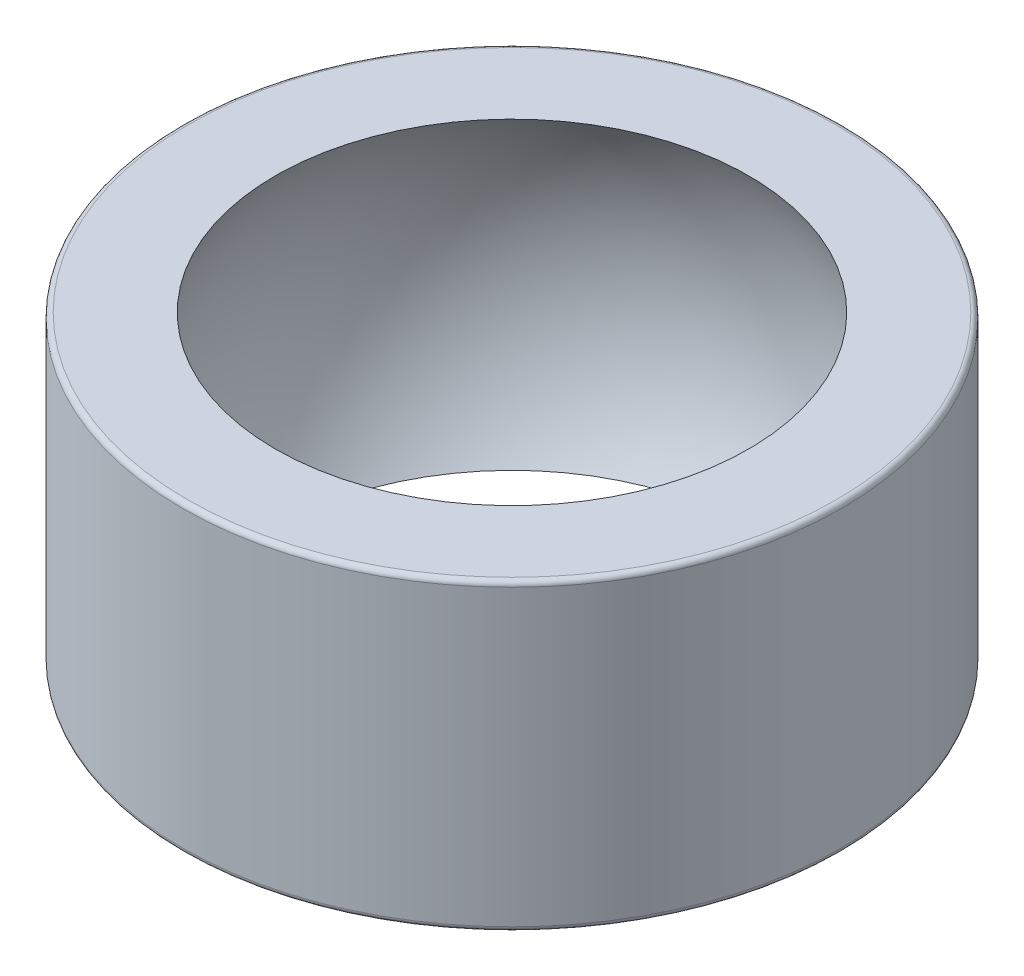
ISO-10303-21;
HEADER;
FILE_DESCRIPTION(('STEP AP214'),'2;1');
FILE_NAME('part.step','',(''),(''),'','','');
FILE_SCHEMA(('AUTOMOTIVE_DESIGN { 1 0 10303 214 1 1 1 1 }'));
ENDSEC;
DATA;
#1=APPLICATION_CONTEXT('core data for automotive mechanical design processes');
#2=APPLICATION_PROTOCOL_DEFINITION('international standard','automotive_design',2000,#1);
#3=PRODUCT_CONTEXT('',#1,'mechanical');
#4=PRODUCT('Part','Part','',(#3));
#5=PRODUCT_RELATED_PRODUCT_CATEGORY('part','',(#4));
#6=PRODUCT_DEFINITION_FORMATION('','',#4);
#7=PRODUCT_DEFINITION_CONTEXT('part definition',#1,'design');
#8=PRODUCT_DEFINITION('design','',#6,#7);
#9=PRODUCT_DEFINITION_SHAPE('','',#8);
#10=(LENGTH_UNIT() NAMED_UNIT(*) SI_UNIT(.MILLI.,.METRE.));
#11=(NAMED_UNIT(*) PLANE_ANGLE_UNIT() SI_UNIT($,.RADIAN.));
#12=(NAMED_UNIT(*) SI_UNIT($,.STERADIAN.) SOLID_ANGLE_UNIT());
#13=UNCERTAINTY_MEASURE_WITH_UNIT(LENGTH_MEASURE(1.E-05),#10,'distance_accuracy_value','');
#14=(GEOMETRIC_REPRESENTATION_CONTEXT(3) GLOBAL_UNCERTAINTY_ASSIGNED_CONTEXT((#13)) GLOBAL_UNIT_ASSIGNED_CONTEXT((#10,
#11,#12)) REPRESENTATION_CONTEXT('',''));
#15=CARTESIAN_POINT('',(0.,0.,0.));
#16=DIRECTION('',(0.,0.,1.));
#17=DIRECTION('',(1.,0.,0.));
#18=AXIS2_PLACEMENT_3D('',#15,#16,#17);
#19=CARTESIAN_POINT('',(0.,6.,0.));
#20=DIRECTION('',(0.,-1.,0.));
#21=DIRECTION('',(0.,0.,-1.));
#22=AXIS2_PLACEMENT_3D('',#19,#20,#21);
#23=CYLINDRICAL_SURFACE('',#22,13.);
#24=CARTESIAN_POINT('',(0.,-5.8,0.));
#25=DIRECTION('',(0.,1.,0.));
#26=DIRECTION('',(0.,0.,1.));
#27=AXIS2_PLACEMENT_3D('',#24,#25,#26);
#28=CIRCLE('',#27,13.);
#29=CARTESIAN_POINT('',(0.,-5.8,13.));
#30=VERTEX_POINT('',#29);
#31=EDGE_CURVE('E42',#30,#30,#28,.T.);
#32=ORIENTED_EDGE('',*,*,#31,.T.);
#33=EDGE_LOOP('',(#32));
#34=FACE_BOUND('',#33,.T.);
#35=CARTESIAN_POINT('',(0.,5.8,0.));
#36=DIRECTION('',(0.,1.,0.));
#37=DIRECTION('',(0.,0.,1.));
#38=AXIS2_PLACEMENT_3D('',#35,#36,#37);
#39=CIRCLE('',#38,13.);
#40=CARTESIAN_POINT('',(0.,5.8,13.));
#41=VERTEX_POINT('',#40);
#42=EDGE_CURVE('E46',#41,#41,#39,.F.);
#43=ORIENTED_EDGE('',*,*,#42,.T.);
#44=EDGE_LOOP('',(#43));
#45=FACE_BOUND('',#44,.T.);
#46=ADVANCED_FACE('F31',(#34,#45),#23,.T.);
#47=CARTESIAN_POINT('',(0.,6.,0.));
#48=DIRECTION('',(0.,1.,0.));
#49=DIRECTION('',(0.,0.,1.));
#50=AXIS2_PLACEMENT_3D('',#47,#48,#49);
#51=PLANE('',#50);
#52=CARTESIAN_POINT('',(0.,6.,0.));
#53=DIRECTION('',(0.,1.,0.));
#54=DIRECTION('',(0.,0.,1.));
#55=AXIS2_PLACEMENT_3D('',#52,#53,#54);
#56=CIRCLE('',#55,12.8);
#57=CARTESIAN_POINT('',(0.,6.,12.8));
#58=VERTEX_POINT('',#57);
#59=EDGE_CURVE('E10',#58,#58,#56,.T.);
#60=ORIENTED_EDGE('',*,*,#59,.T.);
#61=EDGE_LOOP('',(#60));
#62=FACE_BOUND('',#61,.T.);
#63=CARTESIAN_POINT('',(0.,6.,0.));
#64=DIRECTION('',(0.,1.,0.));
#65=DIRECTION('',(0.,0.,1.));
#66=AXIS2_PLACEMENT_3D('',#63,#64,#65);
#67=CIRCLE('',#66,9.33862944976403);
#68=CARTESIAN_POINT('',(0.,6.,9.33862944976403));
#69=VERTEX_POINT('',#68);
#70=EDGE_CURVE('E51',#69,#69,#67,.T.);
#71=ORIENTED_EDGE('',*,*,#70,.F.);
#72=EDGE_LOOP('',(#71));
#73=FACE_BOUND('',#72,.T.);
#74=ADVANCED_FACE('F61',(#62,#73),#51,.T.);
#75=CARTESIAN_POINT('',(0.,-6.,0.));
#76=DIRECTION('',(0.,1.,0.));
#77=DIRECTION('',(0.,0.,1.));
#78=AXIS2_PLACEMENT_3D('',#75,#76,#77);
#79=PLANE('',#78);
#80=CARTESIAN_POINT('',(0.,-6.,0.));
#81=DIRECTION('',(0.,1.,0.));
#82=DIRECTION('',(0.,0.,1.));
#83=AXIS2_PLACEMENT_3D('',#80,#81,#82);
#84=CIRCLE('',#83,12.8);
#85=CARTESIAN_POINT('',(0.,-6.,12.8));
#86=VERTEX_POINT('',#85);
#87=EDGE_CURVE('E38',#86,#86,#84,.F.);
#88=ORIENTED_EDGE('',*,*,#87,.T.);
#89=EDGE_LOOP('',(#88));
#90=FACE_BOUND('',#89,.T.);
#91=CARTESIAN_POINT('',(0.,-6.,0.));
#92=DIRECTION('',(0.,1.,0.));
#93=DIRECTION('',(0.,0.,1.));
#94=AXIS2_PLACEMENT_3D('',#91,#92,#93);
#95=CIRCLE('',#94,9.33862944976403);
#96=CARTESIAN_POINT('',(0.,-6.,9.33862944976403));
#97=VERTEX_POINT('',#96);
#98=EDGE_CURVE('E52',#97,#97,#95,.T.);
#99=ORIENTED_EDGE('',*,*,#98,.T.);
#100=EDGE_LOOP('',(#99));
#101=FACE_BOUND('',#100,.T.);
#102=ADVANCED_FACE('F63',(#90,#101),#79,.F.);
#103=CARTESIAN_POINT('',(0.,0.,0.));
#104=DIRECTION('',(0.,-1.,0.));
#105=DIRECTION('',(-1.,0.,0.));
#106=AXIS2_PLACEMENT_3D('',#103,#104,#105);
#107=SPHERICAL_SURFACE('',#106,11.1);
#108=ORIENTED_EDGE('',*,*,#70,.T.);
#109=EDGE_LOOP('',(#108));
#110=FACE_BOUND('',#109,.T.);
#111=ORIENTED_EDGE('',*,*,#98,.F.);
#112=EDGE_LOOP('',(#111));
#113=FACE_BOUND('',#112,.T.);
#114=ADVANCED_FACE('F58',(#110,#113),#107,.F.);
#115=CARTESIAN_POINT('',(0.,-5.8,0.));
#116=DIRECTION('',(0.,1.,0.));
#117=DIRECTION('',(0.,0.,1.));
#118=AXIS2_PLACEMENT_3D('',#115,#116,#117);
#119=TOROIDAL_SURFACE('',#118,12.8,0.2);
#120=ORIENTED_EDGE('',*,*,#87,.F.);
#121=EDGE_LOOP('',(#120));
#122=FACE_BOUND('',#121,.T.);
#123=ORIENTED_EDGE('',*,*,#31,.F.);
#124=EDGE_LOOP('',(#123));
#125=FACE_BOUND('',#124,.T.);
#126=ADVANCED_FACE('F73',(#122,#125),#119,.T.);
#127=CARTESIAN_POINT('',(0.,5.8,0.));
#128=DIRECTION('',(0.,1.,0.));
#129=DIRECTION('',(0.,0.,1.));
#130=AXIS2_PLACEMENT_3D('',#127,#128,#129);
#131=TOROIDAL_SURFACE('',#130,12.8,0.2);
#132=ORIENTED_EDGE('',*,*,#42,.F.);
#133=EDGE_LOOP('',(#132));
#134=FACE_BOUND('',#133,.T.);
#135=ORIENTED_EDGE('',*,*,#59,.F.);
#136=EDGE_LOOP('',(#135));
#137=FACE_BOUND('',#136,.T.);
#138=ADVANCED_FACE('F33',(#134,#137),#131,.T.);
#139=CLOSED_SHELL('',(#46,#74,#102,#114,#126,#138));
#140=MANIFOLD_SOLID_BREP('B2',#139);
#141=ADVANCED_BREP_SHAPE_REPRESENTATION('',(#18,#140),#14);
#142=SHAPE_DEFINITION_REPRESENTATION(#9,#141);
ENDSEC;
END-ISO-10303-21;
